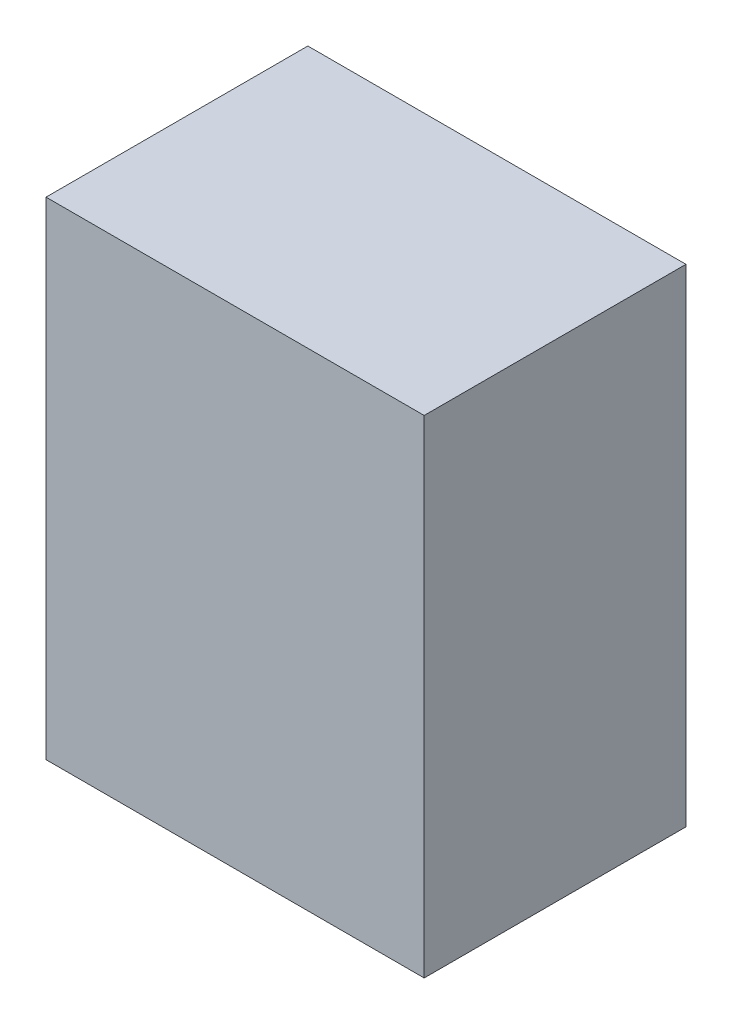
ISO-10303-21;
HEADER;
FILE_DESCRIPTION(('STEP AP214'),'2;1');
FILE_NAME('part.step','',(''),(''),'','','');
FILE_SCHEMA(('AUTOMOTIVE_DESIGN { 1 0 10303 214 1 1 1 1 }'));
ENDSEC;
DATA;
#1=APPLICATION_CONTEXT('core data for automotive mechanical design processes');
#2=APPLICATION_PROTOCOL_DEFINITION('international standard','automotive_design',2000,#1);
#3=PRODUCT_CONTEXT('',#1,'mechanical');
#4=PRODUCT('Part','Part','',(#3));
#5=PRODUCT_RELATED_PRODUCT_CATEGORY('part','',(#4));
#6=PRODUCT_DEFINITION_FORMATION('','',#4);
#7=PRODUCT_DEFINITION_CONTEXT('part definition',#1,'design');
#8=PRODUCT_DEFINITION('design','',#6,#7);
#9=PRODUCT_DEFINITION_SHAPE('','',#8);
#10=(LENGTH_UNIT() NAMED_UNIT(*) SI_UNIT(.MILLI.,.METRE.));
#11=(NAMED_UNIT(*) PLANE_ANGLE_UNIT() SI_UNIT($,.RADIAN.));
#12=(NAMED_UNIT(*) SI_UNIT($,.STERADIAN.) SOLID_ANGLE_UNIT());
#13=UNCERTAINTY_MEASURE_WITH_UNIT(LENGTH_MEASURE(1.E-05),#10,'distance_accuracy_value','');
#14=(GEOMETRIC_REPRESENTATION_CONTEXT(3) GLOBAL_UNCERTAINTY_ASSIGNED_CONTEXT((#13)) GLOBAL_UNIT_ASSIGNED_CONTEXT((#10,
#11,#12)) REPRESENTATION_CONTEXT('',''));
#15=CARTESIAN_POINT('',(0.,0.,0.));
#16=DIRECTION('',(0.,0.,1.));
#17=DIRECTION('',(1.,0.,0.));
#18=AXIS2_PLACEMENT_3D('',#15,#16,#17);
#19=CARTESIAN_POINT('',(330.2,425.45,228.6));
#20=DIRECTION('',(-1.,0.,0.));
#21=DIRECTION('',(0.,0.,1.));
#22=AXIS2_PLACEMENT_3D('',#19,#20,#21);
#23=PLANE('',#22);
#24=DIRECTION('',(0.,0.,-1.));
#25=VECTOR('',#24,1.);
#26=CARTESIAN_POINT('',(330.2,-425.45,228.6));
#27=LINE('',#26,#25);
#28=CARTESIAN_POINT('',(330.2,-425.45,228.6));
#29=VERTEX_POINT('',#28);
#30=CARTESIAN_POINT('',(330.2,-425.45,-228.6));
#31=VERTEX_POINT('',#30);
#32=EDGE_CURVE('E104',#29,#31,#27,.T.);
#33=ORIENTED_EDGE('',*,*,#32,.T.);
#34=DIRECTION('',(0.,-1.,0.));
#35=VECTOR('',#34,1.);
#36=CARTESIAN_POINT('',(330.2,425.45,-228.6));
#37=LINE('',#36,#35);
#38=CARTESIAN_POINT('',(330.2,425.45,-228.6));
#39=VERTEX_POINT('',#38);
#40=EDGE_CURVE('E11',#39,#31,#37,.T.);
#41=ORIENTED_EDGE('',*,*,#40,.F.);
#42=DIRECTION('',(0.,0.,-1.));
#43=VECTOR('',#42,1.);
#44=CARTESIAN_POINT('',(330.2,425.45,228.6));
#45=LINE('',#44,#43);
#46=CARTESIAN_POINT('',(330.2,425.45,228.6));
#47=VERTEX_POINT('',#46);
#48=EDGE_CURVE('E92',#47,#39,#45,.T.);
#49=ORIENTED_EDGE('',*,*,#48,.F.);
#50=DIRECTION('',(0.,-1.,0.));
#51=VECTOR('',#50,1.);
#52=CARTESIAN_POINT('',(330.2,425.45,228.6));
#53=LINE('',#52,#51);
#54=EDGE_CURVE('E100',#47,#29,#53,.T.);
#55=ORIENTED_EDGE('',*,*,#54,.T.);
#56=EDGE_LOOP('',(#33,#41,#49,#55));
#57=FACE_BOUND('',#56,.T.);
#58=ADVANCED_FACE('F41',(#57),#23,.F.);
#59=CARTESIAN_POINT('',(-330.2,425.45,-228.6));
#60=DIRECTION('',(0.,0.,1.));
#61=DIRECTION('',(1.,0.,0.));
#62=AXIS2_PLACEMENT_3D('',#59,#60,#61);
#63=PLANE('',#62);
#64=DIRECTION('',(-1.,0.,0.));
#65=VECTOR('',#64,1.);
#66=CARTESIAN_POINT('',(-330.2,-425.45,-228.6));
#67=LINE('',#66,#65);
#68=CARTESIAN_POINT('',(-330.2,-425.45,-228.6));
#69=VERTEX_POINT('',#68);
#70=EDGE_CURVE('E96',#31,#69,#67,.T.);
#71=ORIENTED_EDGE('',*,*,#70,.T.);
#72=DIRECTION('',(0.,-1.,0.));
#73=VECTOR('',#72,1.);
#74=CARTESIAN_POINT('',(-330.2,425.45,-228.6));
#75=LINE('',#74,#73);
#76=CARTESIAN_POINT('',(-330.2,425.45,-228.6));
#77=VERTEX_POINT('',#76);
#78=EDGE_CURVE('E49',#77,#69,#75,.T.);
#79=ORIENTED_EDGE('',*,*,#78,.F.);
#80=DIRECTION('',(-1.,0.,0.));
#81=VECTOR('',#80,1.);
#82=CARTESIAN_POINT('',(-330.2,425.45,-228.6));
#83=LINE('',#82,#81);
#84=EDGE_CURVE('E87',#39,#77,#83,.T.);
#85=ORIENTED_EDGE('',*,*,#84,.F.);
#86=ORIENTED_EDGE('',*,*,#40,.T.);
#87=EDGE_LOOP('',(#71,#79,#85,#86));
#88=FACE_BOUND('',#87,.T.);
#89=ADVANCED_FACE('F95',(#88),#63,.F.);
#90=CARTESIAN_POINT('',(-330.2,425.45,228.6));
#91=DIRECTION('',(1.,0.,0.));
#92=DIRECTION('',(0.,0.,-1.));
#93=AXIS2_PLACEMENT_3D('',#90,#91,#92);
#94=PLANE('',#93);
#95=DIRECTION('',(0.,0.,1.));
#96=VECTOR('',#95,1.);
#97=CARTESIAN_POINT('',(-330.2,-425.45,228.6));
#98=LINE('',#97,#96);
#99=CARTESIAN_POINT('',(-330.2,-425.45,228.6));
#100=VERTEX_POINT('',#99);
#101=EDGE_CURVE('E74',#69,#100,#98,.T.);
#102=ORIENTED_EDGE('',*,*,#101,.T.);
#103=DIRECTION('',(0.,-1.,0.));
#104=VECTOR('',#103,1.);
#105=CARTESIAN_POINT('',(-330.2,425.45,228.6));
#106=LINE('',#105,#104);
#107=CARTESIAN_POINT('',(-330.2,425.45,228.6));
#108=VERTEX_POINT('',#107);
#109=EDGE_CURVE('E97',#108,#100,#106,.T.);
#110=ORIENTED_EDGE('',*,*,#109,.F.);
#111=DIRECTION('',(0.,0.,1.));
#112=VECTOR('',#111,1.);
#113=CARTESIAN_POINT('',(-330.2,425.45,228.6));
#114=LINE('',#113,#112);
#115=EDGE_CURVE('E90',#77,#108,#114,.T.);
#116=ORIENTED_EDGE('',*,*,#115,.F.);
#117=ORIENTED_EDGE('',*,*,#78,.T.);
#118=EDGE_LOOP('',(#102,#110,#116,#117));
#119=FACE_BOUND('',#118,.T.);
#120=ADVANCED_FACE('F98',(#119),#94,.F.);
#121=CARTESIAN_POINT('',(-330.2,425.45,228.6));
#122=DIRECTION('',(0.,0.,-1.));
#123=DIRECTION('',(-1.,0.,0.));
#124=AXIS2_PLACEMENT_3D('',#121,#122,#123);
#125=PLANE('',#124);
#126=DIRECTION('',(1.,0.,0.));
#127=VECTOR('',#126,1.);
#128=CARTESIAN_POINT('',(-330.2,-425.45,228.6));
#129=LINE('',#128,#127);
#130=EDGE_CURVE('E80',#100,#29,#129,.T.);
#131=ORIENTED_EDGE('',*,*,#130,.T.);
#132=ORIENTED_EDGE('',*,*,#54,.F.);
#133=DIRECTION('',(1.,0.,0.));
#134=VECTOR('',#133,1.);
#135=CARTESIAN_POINT('',(-330.2,425.45,228.6));
#136=LINE('',#135,#134);
#137=EDGE_CURVE('E57',#108,#47,#136,.T.);
#138=ORIENTED_EDGE('',*,*,#137,.F.);
#139=ORIENTED_EDGE('',*,*,#109,.T.);
#140=EDGE_LOOP('',(#131,#132,#138,#139));
#141=FACE_BOUND('',#140,.T.);
#142=ADVANCED_FACE('F111',(#141),#125,.F.);
#143=CARTESIAN_POINT('',(0.,425.45,0.));
#144=DIRECTION('',(0.,-1.,0.));
#145=DIRECTION('',(0.,0.,-1.));
#146=AXIS2_PLACEMENT_3D('',#143,#144,#145);
#147=PLANE('',#146);
#148=ORIENTED_EDGE('',*,*,#48,.T.);
#149=ORIENTED_EDGE('',*,*,#84,.T.);
#150=ORIENTED_EDGE('',*,*,#115,.T.);
#151=ORIENTED_EDGE('',*,*,#137,.T.);
#152=EDGE_LOOP('',(#148,#149,#150,#151));
#153=FACE_BOUND('',#152,.T.);
#154=ADVANCED_FACE('F88',(#153),#147,.F.);
#155=CARTESIAN_POINT('',(0.,-425.45,0.));
#156=DIRECTION('',(0.,-1.,0.));
#157=DIRECTION('',(0.,0.,-1.));
#158=AXIS2_PLACEMENT_3D('',#155,#156,#157);
#159=PLANE('',#158);
#160=ORIENTED_EDGE('',*,*,#32,.F.);
#161=ORIENTED_EDGE('',*,*,#130,.F.);
#162=ORIENTED_EDGE('',*,*,#101,.F.);
#163=ORIENTED_EDGE('',*,*,#70,.F.);
#164=EDGE_LOOP('',(#160,#161,#162,#163));
#165=FACE_BOUND('',#164,.T.);
#166=ADVANCED_FACE('F114',(#165),#159,.T.);
#167=CLOSED_SHELL('',(#58,#89,#120,#142,#154,#166));
#168=MANIFOLD_SOLID_BREP('B2',#167);
#169=ADVANCED_BREP_SHAPE_REPRESENTATION('',(#18,#168),#14);
#170=SHAPE_DEFINITION_REPRESENTATION(#9,#169);
ENDSEC;
END-ISO-10303-21;
